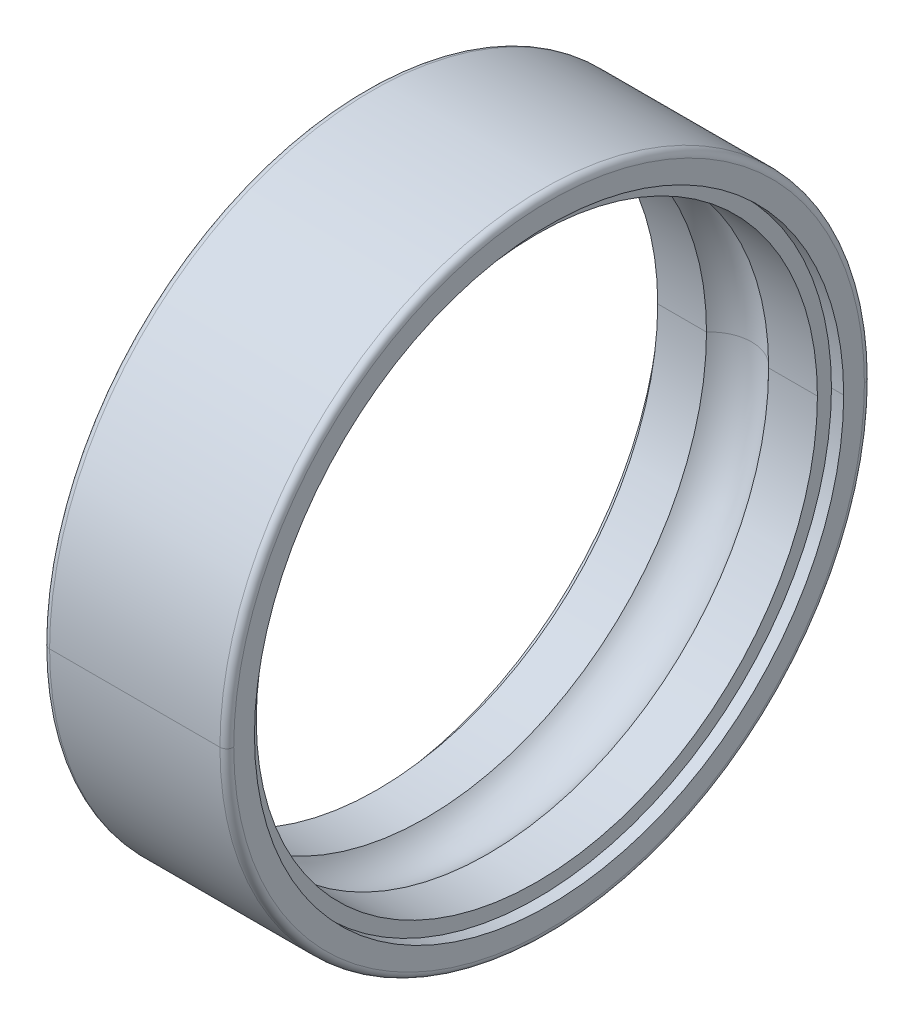
ISO-10303-21;
HEADER;
FILE_DESCRIPTION(('STEP AP214'),'2;1');
FILE_NAME('part.step','',(''),(''),'','','');
FILE_SCHEMA(('AUTOMOTIVE_DESIGN { 1 0 10303 214 1 1 1 1 }'));
ENDSEC;
DATA;
#1=APPLICATION_CONTEXT('core data for automotive mechanical design processes');
#2=APPLICATION_PROTOCOL_DEFINITION('international standard','automotive_design',2000,#1);
#3=PRODUCT_CONTEXT('',#1,'mechanical');
#4=PRODUCT('Part','Part','',(#3));
#5=PRODUCT_RELATED_PRODUCT_CATEGORY('part','',(#4));
#6=PRODUCT_DEFINITION_FORMATION('','',#4);
#7=PRODUCT_DEFINITION_CONTEXT('part definition',#1,'design');
#8=PRODUCT_DEFINITION('design','',#6,#7);
#9=PRODUCT_DEFINITION_SHAPE('','',#8);
#10=(LENGTH_UNIT() NAMED_UNIT(*) SI_UNIT(.MILLI.,.METRE.));
#11=(NAMED_UNIT(*) PLANE_ANGLE_UNIT() SI_UNIT($,.RADIAN.));
#12=(NAMED_UNIT(*) SI_UNIT($,.STERADIAN.) SOLID_ANGLE_UNIT());
#13=UNCERTAINTY_MEASURE_WITH_UNIT(LENGTH_MEASURE(1.E-05),#10,'distance_accuracy_value','');
#14=(GEOMETRIC_REPRESENTATION_CONTEXT(3) GLOBAL_UNCERTAINTY_ASSIGNED_CONTEXT((#13)) GLOBAL_UNIT_ASSIGNED_CONTEXT((#10,
#11,#12)) REPRESENTATION_CONTEXT('',''));
#15=CARTESIAN_POINT('',(0.,0.,0.));
#16=DIRECTION('',(0.,0.,1.));
#17=DIRECTION('',(1.,0.,0.));
#18=AXIS2_PLACEMENT_3D('',#15,#16,#17);
#19=CARTESIAN_POINT('',(0.,6.85,0.));
#20=DIRECTION('',(-1.,0.,0.));
#21=DIRECTION('',(0.,0.,1.));
#22=AXIS2_PLACEMENT_3D('',#19,#20,#21);
#23=PLANE('',#22);
#24=CARTESIAN_POINT('',(0.,0.,0.));
#25=DIRECTION('',(1.,0.,0.));
#26=DIRECTION('',(0.,0.,-1.));
#27=AXIS2_PLACEMENT_3D('',#24,#25,#26);
#28=CIRCLE('',#27,6.4);
#29=CARTESIAN_POINT('',(0.,0.,-6.4));
#30=VERTEX_POINT('',#29);
#31=CARTESIAN_POINT('',(0.,0.,6.4));
#32=VERTEX_POINT('',#31);
#33=EDGE_CURVE('E209',#30,#32,#28,.T.);
#34=ORIENTED_EDGE('',*,*,#33,.T.);
#35=CARTESIAN_POINT('',(0.,0.,0.));
#36=DIRECTION('',(1.,0.,0.));
#37=DIRECTION('',(0.,0.,-1.));
#38=AXIS2_PLACEMENT_3D('',#35,#36,#37);
#39=CIRCLE('',#38,6.4);
#40=EDGE_CURVE('E11',#32,#30,#39,.T.);
#41=ORIENTED_EDGE('',*,*,#40,.T.);
#42=EDGE_LOOP('',(#34,#41));
#43=FACE_BOUND('',#42,.T.);
#44=CARTESIAN_POINT('',(0.,0.,0.));
#45=DIRECTION('',(1.,0.,0.));
#46=DIRECTION('',(0.,0.,-1.));
#47=AXIS2_PLACEMENT_3D('',#44,#45,#46);
#48=CIRCLE('',#47,6.85);
#49=CARTESIAN_POINT('',(0.,0.,-6.85));
#50=VERTEX_POINT('',#49);
#51=CARTESIAN_POINT('',(0.,0.,6.85));
#52=VERTEX_POINT('',#51);
#53=EDGE_CURVE('E195',#50,#52,#48,.T.);
#54=ORIENTED_EDGE('',*,*,#53,.F.);
#55=CARTESIAN_POINT('',(0.,0.,0.));
#56=DIRECTION('',(1.,0.,0.));
#57=DIRECTION('',(0.,0.,-1.));
#58=AXIS2_PLACEMENT_3D('',#55,#56,#57);
#59=CIRCLE('',#58,6.85);
#60=EDGE_CURVE('E42',#52,#50,#59,.T.);
#61=ORIENTED_EDGE('',*,*,#60,.F.);
#62=EDGE_LOOP('',(#54,#61));
#63=FACE_BOUND('',#62,.T.);
#64=ADVANCED_FACE('F17',(#43,#63),#23,.T.);
#65=CARTESIAN_POINT('',(4.,0.,0.));
#66=DIRECTION('',(-1.,0.,0.));
#67=DIRECTION('',(0.,0.,-1.));
#68=AXIS2_PLACEMENT_3D('',#65,#66,#67);
#69=CYLINDRICAL_SURFACE('',#68,6.4);
#70=DIRECTION('',(-1.,0.,0.));
#71=VECTOR('',#70,1.);
#72=CARTESIAN_POINT('',(4.,0.,6.4));
#73=LINE('',#72,#71);
#74=CARTESIAN_POINT('',(0.2656,0.,6.4));
#75=VERTEX_POINT('',#74);
#76=EDGE_CURVE('E189',#75,#32,#73,.T.);
#77=ORIENTED_EDGE('',*,*,#76,.F.);
#78=CARTESIAN_POINT('',(0.2656,0.,0.));
#79=DIRECTION('',(1.,0.,0.));
#80=DIRECTION('',(0.,0.,-1.));
#81=AXIS2_PLACEMENT_3D('',#78,#79,#80);
#82=CIRCLE('',#81,6.4);
#83=CARTESIAN_POINT('',(0.2656,0.,-6.4));
#84=VERTEX_POINT('',#83);
#85=EDGE_CURVE('E28',#75,#84,#82,.T.);
#86=ORIENTED_EDGE('',*,*,#85,.T.);
#87=DIRECTION('',(-1.,0.,0.));
#88=VECTOR('',#87,1.);
#89=CARTESIAN_POINT('',(4.,0.,-6.4));
#90=LINE('',#89,#88);
#91=EDGE_CURVE('E213',#84,#30,#90,.T.);
#92=ORIENTED_EDGE('',*,*,#91,.T.);
#93=ORIENTED_EDGE('',*,*,#40,.F.);
#94=EDGE_LOOP('',(#77,#86,#92,#93));
#95=FACE_BOUND('',#94,.T.);
#96=ADVANCED_FACE('F288',(#95),#69,.F.);
#97=CARTESIAN_POINT('',(0.2656,6.4,0.));
#98=DIRECTION('',(-1.,0.,0.));
#99=DIRECTION('',(0.,0.,1.));
#100=AXIS2_PLACEMENT_3D('',#97,#98,#99);
#101=PLANE('',#100);
#102=CARTESIAN_POINT('',(0.2656,0.,0.));
#103=DIRECTION('',(1.,0.,0.));
#104=DIRECTION('',(0.,0.,-1.));
#105=AXIS2_PLACEMENT_3D('',#102,#103,#104);
#106=CIRCLE('',#105,6.095);
#107=CARTESIAN_POINT('',(0.2656,0.,-6.095));
#108=VERTEX_POINT('',#107);
#109=CARTESIAN_POINT('',(0.2656,0.,6.095));
#110=VERTEX_POINT('',#109);
#111=EDGE_CURVE('E230',#108,#110,#106,.T.);
#112=ORIENTED_EDGE('',*,*,#111,.T.);
#113=CARTESIAN_POINT('',(0.2656,0.,0.));
#114=DIRECTION('',(1.,0.,0.));
#115=DIRECTION('',(0.,0.,-1.));
#116=AXIS2_PLACEMENT_3D('',#113,#114,#115);
#117=CIRCLE('',#116,6.095);
#118=EDGE_CURVE('E84',#110,#108,#117,.T.);
#119=ORIENTED_EDGE('',*,*,#118,.T.);
#120=EDGE_LOOP('',(#112,#119));
#121=FACE_BOUND('',#120,.T.);
#122=CARTESIAN_POINT('',(0.2656,0.,0.));
#123=DIRECTION('',(1.,0.,0.));
#124=DIRECTION('',(0.,0.,-1.));
#125=AXIS2_PLACEMENT_3D('',#122,#123,#124);
#126=CIRCLE('',#125,6.4);
#127=EDGE_CURVE('E625',#84,#75,#126,.T.);
#128=ORIENTED_EDGE('',*,*,#127,.F.);
#129=ORIENTED_EDGE('',*,*,#85,.F.);
#130=EDGE_LOOP('',(#128,#129));
#131=FACE_BOUND('',#130,.T.);
#132=ADVANCED_FACE('F295',(#121,#131),#101,.T.);
#133=CARTESIAN_POINT('',(4.,0.,0.));
#134=DIRECTION('',(-1.,0.,0.));
#135=DIRECTION('',(0.,0.,-1.));
#136=AXIS2_PLACEMENT_3D('',#133,#134,#135);
#137=CYLINDRICAL_SURFACE('',#136,6.095);
#138=DIRECTION('',(-1.,0.,0.));
#139=VECTOR('',#138,1.);
#140=CARTESIAN_POINT('',(4.,0.,6.095));
#141=LINE('',#140,#139);
#142=CARTESIAN_POINT('',(1.32474079051078,0.,6.095));
#143=VERTEX_POINT('',#142);
#144=EDGE_CURVE('E243',#143,#110,#141,.T.);
#145=ORIENTED_EDGE('',*,*,#144,.F.);
#146=CARTESIAN_POINT('',(1.32474079051078,0.,0.));
#147=DIRECTION('',(1.,0.,0.));
#148=DIRECTION('',(0.,0.,-1.));
#149=AXIS2_PLACEMENT_3D('',#146,#147,#148);
#150=CIRCLE('',#149,6.095);
#151=CARTESIAN_POINT('',(1.32474079051078,0.,-6.095));
#152=VERTEX_POINT('',#151);
#153=EDGE_CURVE('E229',#143,#152,#150,.T.);
#154=ORIENTED_EDGE('',*,*,#153,.T.);
#155=DIRECTION('',(-1.,0.,0.));
#156=VECTOR('',#155,1.);
#157=CARTESIAN_POINT('',(4.,0.,-6.095));
#158=LINE('',#157,#156);
#159=EDGE_CURVE('E226',#152,#108,#158,.T.);
#160=ORIENTED_EDGE('',*,*,#159,.T.);
#161=ORIENTED_EDGE('',*,*,#118,.F.);
#162=EDGE_LOOP('',(#145,#154,#160,#161));
#163=FACE_BOUND('',#162,.T.);
#164=ADVANCED_FACE('F322',(#163),#137,.F.);
#165=CARTESIAN_POINT('',(2.,0.,0.));
#166=DIRECTION('',(1.,0.,0.));
#167=DIRECTION('',(0.,0.,-1.));
#168=AXIS2_PLACEMENT_3D('',#165,#166,#167);
#169=TOROIDAL_SURFACE('',#168,5.5,0.9);
#170=CARTESIAN_POINT('',(2.,0.,5.5));
#171=DIRECTION('',(0.,1.,0.));
#172=DIRECTION('',(0.,0.,1.));
#173=AXIS2_PLACEMENT_3D('',#170,#171,#172);
#174=CIRCLE('',#173,0.9);
#175=CARTESIAN_POINT('',(2.67525920948922,0.,6.095));
#176=VERTEX_POINT('',#175);
#177=EDGE_CURVE('E21',#143,#176,#174,.T.);
#178=ORIENTED_EDGE('',*,*,#177,.F.);
#179=CARTESIAN_POINT('',(1.32474079051078,0.,0.));
#180=DIRECTION('',(1.,0.,0.));
#181=DIRECTION('',(0.,0.,-1.));
#182=AXIS2_PLACEMENT_3D('',#179,#180,#181);
#183=CIRCLE('',#182,6.095);
#184=EDGE_CURVE('E223',#152,#143,#183,.T.);
#185=ORIENTED_EDGE('',*,*,#184,.F.);
#186=CARTESIAN_POINT('',(2.,0.,-5.5));
#187=DIRECTION('',(0.,-1.,0.));
#188=DIRECTION('',(0.,0.,-1.));
#189=AXIS2_PLACEMENT_3D('',#186,#187,#188);
#190=CIRCLE('',#189,0.9);
#191=CARTESIAN_POINT('',(2.67525920948922,0.,-6.095));
#192=VERTEX_POINT('',#191);
#193=EDGE_CURVE('E219',#152,#192,#190,.T.);
#194=ORIENTED_EDGE('',*,*,#193,.T.);
#195=CARTESIAN_POINT('',(2.67525920948922,0.,0.));
#196=DIRECTION('',(1.,0.,0.));
#197=DIRECTION('',(0.,0.,-1.));
#198=AXIS2_PLACEMENT_3D('',#195,#196,#197);
#199=CIRCLE('',#198,6.095);
#200=EDGE_CURVE('E70',#192,#176,#199,.T.);
#201=ORIENTED_EDGE('',*,*,#200,.T.);
#202=EDGE_LOOP('',(#178,#185,#194,#201));
#203=FACE_BOUND('',#202,.T.);
#204=ADVANCED_FACE('F304',(#203),#169,.F.);
#205=CARTESIAN_POINT('',(4.,0.,0.));
#206=DIRECTION('',(-1.,0.,0.));
#207=DIRECTION('',(0.,0.,-1.));
#208=AXIS2_PLACEMENT_3D('',#205,#206,#207);
#209=CYLINDRICAL_SURFACE('',#208,6.095);
#210=DIRECTION('',(-1.,0.,0.));
#211=VECTOR('',#210,1.);
#212=CARTESIAN_POINT('',(4.,0.,6.095));
#213=LINE('',#212,#211);
#214=CARTESIAN_POINT('',(3.7344,0.,6.095));
#215=VERTEX_POINT('',#214);
#216=EDGE_CURVE('E218',#215,#176,#213,.T.);
#217=ORIENTED_EDGE('',*,*,#216,.F.);
#218=CARTESIAN_POINT('',(3.7344,0.,0.));
#219=DIRECTION('',(1.,0.,0.));
#220=DIRECTION('',(0.,0.,-1.));
#221=AXIS2_PLACEMENT_3D('',#218,#219,#220);
#222=CIRCLE('',#221,6.095);
#223=CARTESIAN_POINT('',(3.7344,0.,-6.095));
#224=VERTEX_POINT('',#223);
#225=EDGE_CURVE('E206',#215,#224,#222,.T.);
#226=ORIENTED_EDGE('',*,*,#225,.T.);
#227=DIRECTION('',(-1.,0.,0.));
#228=VECTOR('',#227,1.);
#229=CARTESIAN_POINT('',(4.,0.,-6.095));
#230=LINE('',#229,#228);
#231=EDGE_CURVE('E252',#224,#192,#230,.T.);
#232=ORIENTED_EDGE('',*,*,#231,.T.);
#233=CARTESIAN_POINT('',(2.67525920948922,0.,0.));
#234=DIRECTION('',(1.,0.,0.));
#235=DIRECTION('',(0.,0.,-1.));
#236=AXIS2_PLACEMENT_3D('',#233,#234,#235);
#237=CIRCLE('',#236,6.095);
#238=EDGE_CURVE('E259',#176,#192,#237,.T.);
#239=ORIENTED_EDGE('',*,*,#238,.F.);
#240=EDGE_LOOP('',(#217,#226,#232,#239));
#241=FACE_BOUND('',#240,.T.);
#242=ADVANCED_FACE('F300',(#241),#209,.F.);
#243=CARTESIAN_POINT('',(3.7344,6.095,0.));
#244=DIRECTION('',(1.,0.,0.));
#245=DIRECTION('',(0.,1.,0.));
#246=AXIS2_PLACEMENT_3D('',#243,#244,#245);
#247=PLANE('',#246);
#248=CARTESIAN_POINT('',(3.7344,0.,0.));
#249=DIRECTION('',(1.,0.,0.));
#250=DIRECTION('',(0.,0.,-1.));
#251=AXIS2_PLACEMENT_3D('',#248,#249,#250);
#252=CIRCLE('',#251,6.095);
#253=EDGE_CURVE('E214',#224,#215,#252,.T.);
#254=ORIENTED_EDGE('',*,*,#253,.F.);
#255=ORIENTED_EDGE('',*,*,#225,.F.);
#256=EDGE_LOOP('',(#254,#255));
#257=FACE_BOUND('',#256,.T.);
#258=CARTESIAN_POINT('',(3.7344,0.,0.));
#259=DIRECTION('',(1.,0.,0.));
#260=DIRECTION('',(0.,0.,-1.));
#261=AXIS2_PLACEMENT_3D('',#258,#259,#260);
#262=CIRCLE('',#261,6.4);
#263=CARTESIAN_POINT('',(3.7344,0.,-6.4));
#264=VERTEX_POINT('',#263);
#265=CARTESIAN_POINT('',(3.7344,0.,6.4));
#266=VERTEX_POINT('',#265);
#267=EDGE_CURVE('E196',#264,#266,#262,.T.);
#268=ORIENTED_EDGE('',*,*,#267,.T.);
#269=CARTESIAN_POINT('',(3.7344,0.,0.));
#270=DIRECTION('',(1.,0.,0.));
#271=DIRECTION('',(0.,0.,-1.));
#272=AXIS2_PLACEMENT_3D('',#269,#270,#271);
#273=CIRCLE('',#272,6.4);
#274=EDGE_CURVE('E134',#266,#264,#273,.T.);
#275=ORIENTED_EDGE('',*,*,#274,.T.);
#276=EDGE_LOOP('',(#268,#275));
#277=FACE_BOUND('',#276,.T.);
#278=ADVANCED_FACE('F303',(#257,#277),#247,.T.);
#279=CARTESIAN_POINT('',(4.,0.,0.));
#280=DIRECTION('',(-1.,0.,0.));
#281=DIRECTION('',(0.,0.,-1.));
#282=AXIS2_PLACEMENT_3D('',#279,#280,#281);
#283=CYLINDRICAL_SURFACE('',#282,6.4);
#284=DIRECTION('',(-1.,0.,0.));
#285=VECTOR('',#284,1.);
#286=CARTESIAN_POINT('',(4.,0.,6.4));
#287=LINE('',#286,#285);
#288=CARTESIAN_POINT('',(4.,0.,6.4));
#289=VERTEX_POINT('',#288);
#290=EDGE_CURVE('E199',#289,#266,#287,.T.);
#291=ORIENTED_EDGE('',*,*,#290,.F.);
#292=CARTESIAN_POINT('',(4.,0.,0.));
#293=DIRECTION('',(1.,0.,0.));
#294=DIRECTION('',(0.,0.,-1.));
#295=AXIS2_PLACEMENT_3D('',#292,#293,#294);
#296=CIRCLE('',#295,6.4);
#297=CARTESIAN_POINT('',(4.,0.,-6.4));
#298=VERTEX_POINT('',#297);
#299=EDGE_CURVE('E145',#289,#298,#296,.T.);
#300=ORIENTED_EDGE('',*,*,#299,.T.);
#301=DIRECTION('',(-1.,0.,0.));
#302=VECTOR('',#301,1.);
#303=CARTESIAN_POINT('',(4.,0.,-6.4));
#304=LINE('',#303,#302);
#305=EDGE_CURVE('E185',#298,#264,#304,.T.);
#306=ORIENTED_EDGE('',*,*,#305,.T.);
#307=ORIENTED_EDGE('',*,*,#274,.F.);
#308=EDGE_LOOP('',(#291,#300,#306,#307));
#309=FACE_BOUND('',#308,.T.);
#310=ADVANCED_FACE('F308',(#309),#283,.F.);
#311=CARTESIAN_POINT('',(4.,6.4,0.));
#312=DIRECTION('',(1.,0.,0.));
#313=DIRECTION('',(0.,1.,0.));
#314=AXIS2_PLACEMENT_3D('',#311,#312,#313);
#315=PLANE('',#314);
#316=CARTESIAN_POINT('',(4.,0.,0.));
#317=DIRECTION('',(1.,0.,0.));
#318=DIRECTION('',(0.,0.,-1.));
#319=AXIS2_PLACEMENT_3D('',#316,#317,#318);
#320=CIRCLE('',#319,6.4);
#321=EDGE_CURVE('E255',#298,#289,#320,.T.);
#322=ORIENTED_EDGE('',*,*,#321,.F.);
#323=ORIENTED_EDGE('',*,*,#299,.F.);
#324=EDGE_LOOP('',(#322,#323));
#325=FACE_BOUND('',#324,.T.);
#326=CARTESIAN_POINT('',(4.,0.,0.));
#327=DIRECTION('',(1.,0.,0.));
#328=DIRECTION('',(0.,0.,-1.));
#329=AXIS2_PLACEMENT_3D('',#326,#327,#328);
#330=CIRCLE('',#329,6.85);
#331=CARTESIAN_POINT('',(4.,0.,-6.85));
#332=VERTEX_POINT('',#331);
#333=CARTESIAN_POINT('',(4.,0.,6.85));
#334=VERTEX_POINT('',#333);
#335=EDGE_CURVE('E170',#332,#334,#330,.T.);
#336=ORIENTED_EDGE('',*,*,#335,.T.);
#337=CARTESIAN_POINT('',(4.,0.,0.));
#338=DIRECTION('',(1.,0.,0.));
#339=DIRECTION('',(0.,0.,-1.));
#340=AXIS2_PLACEMENT_3D('',#337,#338,#339);
#341=CIRCLE('',#340,6.85);
#342=EDGE_CURVE('E157',#334,#332,#341,.T.);
#343=ORIENTED_EDGE('',*,*,#342,.T.);
#344=EDGE_LOOP('',(#336,#343));
#345=FACE_BOUND('',#344,.T.);
#346=ADVANCED_FACE('F171',(#325,#345),#315,.T.);
#347=CARTESIAN_POINT('',(3.85,0.,0.));
#348=DIRECTION('',(1.,0.,0.));
#349=DIRECTION('',(0.,0.,-1.));
#350=AXIS2_PLACEMENT_3D('',#347,#348,#349);
#351=TOROIDAL_SURFACE('',#350,6.85,0.15);
#352=CARTESIAN_POINT('',(3.85,0.,6.85));
#353=DIRECTION('',(0.,1.,0.));
#354=DIRECTION('',(0.,0.,1.));
#355=AXIS2_PLACEMENT_3D('',#352,#353,#354);
#356=CIRCLE('',#355,0.15);
#357=CARTESIAN_POINT('',(3.85,0.,7.));
#358=VERTEX_POINT('',#357);
#359=EDGE_CURVE('E162',#358,#334,#356,.T.);
#360=ORIENTED_EDGE('',*,*,#359,.F.);
#361=CARTESIAN_POINT('',(3.85,0.,0.));
#362=DIRECTION('',(1.,0.,0.));
#363=DIRECTION('',(0.,0.,-1.));
#364=AXIS2_PLACEMENT_3D('',#361,#362,#363);
#365=CIRCLE('',#364,7.);
#366=CARTESIAN_POINT('',(3.85,0.,-7.));
#367=VERTEX_POINT('',#366);
#368=EDGE_CURVE('E205',#358,#367,#365,.T.);
#369=ORIENTED_EDGE('',*,*,#368,.T.);
#370=CARTESIAN_POINT('',(3.85,0.,-6.85));
#371=DIRECTION('',(0.,-1.,0.));
#372=DIRECTION('',(0.,0.,-1.));
#373=AXIS2_PLACEMENT_3D('',#370,#371,#372);
#374=CIRCLE('',#373,0.15);
#375=EDGE_CURVE('E165',#367,#332,#374,.T.);
#376=ORIENTED_EDGE('',*,*,#375,.T.);
#377=ORIENTED_EDGE('',*,*,#342,.F.);
#378=EDGE_LOOP('',(#360,#369,#376,#377));
#379=FACE_BOUND('',#378,.T.);
#380=ADVANCED_FACE('F159',(#379),#351,.T.);
#381=CARTESIAN_POINT('',(4.,0.,0.));
#382=DIRECTION('',(-1.,0.,0.));
#383=DIRECTION('',(0.,0.,-1.));
#384=AXIS2_PLACEMENT_3D('',#381,#382,#383);
#385=CYLINDRICAL_SURFACE('',#384,7.);
#386=DIRECTION('',(-1.,0.,0.));
#387=VECTOR('',#386,1.);
#388=CARTESIAN_POINT('',(4.,0.,7.));
#389=LINE('',#388,#387);
#390=CARTESIAN_POINT('',(0.15,0.,7.));
#391=VERTEX_POINT('',#390);
#392=EDGE_CURVE('E200',#358,#391,#389,.T.);
#393=ORIENTED_EDGE('',*,*,#392,.F.);
#394=CARTESIAN_POINT('',(3.85,0.,0.));
#395=DIRECTION('',(1.,0.,0.));
#396=DIRECTION('',(0.,0.,-1.));
#397=AXIS2_PLACEMENT_3D('',#394,#395,#396);
#398=CIRCLE('',#397,7.);
#399=EDGE_CURVE('E177',#367,#358,#398,.T.);
#400=ORIENTED_EDGE('',*,*,#399,.F.);
#401=DIRECTION('',(-1.,0.,0.));
#402=VECTOR('',#401,1.);
#403=CARTESIAN_POINT('',(4.,0.,-7.));
#404=LINE('',#403,#402);
#405=CARTESIAN_POINT('',(0.15,0.,-7.));
#406=VERTEX_POINT('',#405);
#407=EDGE_CURVE('E270',#367,#406,#404,.T.);
#408=ORIENTED_EDGE('',*,*,#407,.T.);
#409=CARTESIAN_POINT('',(0.15,0.,0.));
#410=DIRECTION('',(1.,0.,0.));
#411=DIRECTION('',(0.,0.,-1.));
#412=AXIS2_PLACEMENT_3D('',#409,#410,#411);
#413=CIRCLE('',#412,7.);
#414=EDGE_CURVE('E194',#406,#391,#413,.T.);
#415=ORIENTED_EDGE('',*,*,#414,.T.);
#416=EDGE_LOOP('',(#393,#400,#408,#415));
#417=FACE_BOUND('',#416,.T.);
#418=ADVANCED_FACE('F325',(#417),#385,.T.);
#419=CARTESIAN_POINT('',(0.15,0.,0.));
#420=DIRECTION('',(1.,0.,0.));
#421=DIRECTION('',(0.,0.,-1.));
#422=AXIS2_PLACEMENT_3D('',#419,#420,#421);
#423=TOROIDAL_SURFACE('',#422,6.85,0.15);
#424=CARTESIAN_POINT('',(0.15,0.,6.85));
#425=DIRECTION('',(0.,1.,0.));
#426=DIRECTION('',(0.,0.,1.));
#427=AXIS2_PLACEMENT_3D('',#424,#425,#426);
#428=CIRCLE('',#427,0.15);
#429=EDGE_CURVE('E191',#52,#391,#428,.T.);
#430=ORIENTED_EDGE('',*,*,#429,.F.);
#431=ORIENTED_EDGE('',*,*,#60,.T.);
#432=CARTESIAN_POINT('',(0.15,0.,-6.85));
#433=DIRECTION('',(0.,-1.,0.));
#434=DIRECTION('',(0.,0.,-1.));
#435=AXIS2_PLACEMENT_3D('',#432,#433,#434);
#436=CIRCLE('',#435,0.15);
#437=EDGE_CURVE('E233',#50,#406,#436,.T.);
#438=ORIENTED_EDGE('',*,*,#437,.T.);
#439=CARTESIAN_POINT('',(0.15,0.,0.));
#440=DIRECTION('',(1.,0.,0.));
#441=DIRECTION('',(0.,0.,-1.));
#442=AXIS2_PLACEMENT_3D('',#439,#440,#441);
#443=CIRCLE('',#442,7.);
#444=EDGE_CURVE('E204',#391,#406,#443,.T.);
#445=ORIENTED_EDGE('',*,*,#444,.F.);
#446=EDGE_LOOP('',(#430,#431,#438,#445));
#447=FACE_BOUND('',#446,.T.);
#448=ADVANCED_FACE('F282',(#447),#423,.T.);
#449=CARTESIAN_POINT('',(0.15,0.,0.));
#450=DIRECTION('',(1.,0.,0.));
#451=DIRECTION('',(0.,0.,-1.));
#452=AXIS2_PLACEMENT_3D('',#449,#450,#451);
#453=TOROIDAL_SURFACE('',#452,6.85,0.15);
#454=ORIENTED_EDGE('',*,*,#53,.T.);
#455=ORIENTED_EDGE('',*,*,#429,.T.);
#456=ORIENTED_EDGE('',*,*,#414,.F.);
#457=ORIENTED_EDGE('',*,*,#437,.F.);
#458=EDGE_LOOP('',(#454,#455,#456,#457));
#459=FACE_BOUND('',#458,.T.);
#460=ADVANCED_FACE('F286',(#459),#453,.T.);
#461=CARTESIAN_POINT('',(4.,0.,0.));
#462=DIRECTION('',(-1.,0.,0.));
#463=DIRECTION('',(0.,0.,-1.));
#464=AXIS2_PLACEMENT_3D('',#461,#462,#463);
#465=CYLINDRICAL_SURFACE('',#464,7.);
#466=ORIENTED_EDGE('',*,*,#368,.F.);
#467=ORIENTED_EDGE('',*,*,#392,.T.);
#468=ORIENTED_EDGE('',*,*,#444,.T.);
#469=ORIENTED_EDGE('',*,*,#407,.F.);
#470=EDGE_LOOP('',(#466,#467,#468,#469));
#471=FACE_BOUND('',#470,.T.);
#472=ADVANCED_FACE('F329',(#471),#465,.T.);
#473=CARTESIAN_POINT('',(3.85,0.,0.));
#474=DIRECTION('',(1.,0.,0.));
#475=DIRECTION('',(0.,0.,-1.));
#476=AXIS2_PLACEMENT_3D('',#473,#474,#475);
#477=TOROIDAL_SURFACE('',#476,6.85,0.15);
#478=ORIENTED_EDGE('',*,*,#399,.T.);
#479=ORIENTED_EDGE('',*,*,#359,.T.);
#480=ORIENTED_EDGE('',*,*,#335,.F.);
#481=ORIENTED_EDGE('',*,*,#375,.F.);
#482=EDGE_LOOP('',(#478,#479,#480,#481));
#483=FACE_BOUND('',#482,.T.);
#484=ADVANCED_FACE('F175',(#483),#477,.T.);
#485=CARTESIAN_POINT('',(4.,0.,0.));
#486=DIRECTION('',(-1.,0.,0.));
#487=DIRECTION('',(0.,0.,-1.));
#488=AXIS2_PLACEMENT_3D('',#485,#486,#487);
#489=CYLINDRICAL_SURFACE('',#488,6.4);
#490=ORIENTED_EDGE('',*,*,#321,.T.);
#491=ORIENTED_EDGE('',*,*,#290,.T.);
#492=ORIENTED_EDGE('',*,*,#267,.F.);
#493=ORIENTED_EDGE('',*,*,#305,.F.);
#494=EDGE_LOOP('',(#490,#491,#492,#493));
#495=FACE_BOUND('',#494,.T.);
#496=ADVANCED_FACE('F310',(#495),#489,.F.);
#497=CARTESIAN_POINT('',(4.,0.,0.));
#498=DIRECTION('',(-1.,0.,0.));
#499=DIRECTION('',(0.,0.,-1.));
#500=AXIS2_PLACEMENT_3D('',#497,#498,#499);
#501=CYLINDRICAL_SURFACE('',#500,6.095);
#502=ORIENTED_EDGE('',*,*,#253,.T.);
#503=ORIENTED_EDGE('',*,*,#216,.T.);
#504=ORIENTED_EDGE('',*,*,#200,.F.);
#505=ORIENTED_EDGE('',*,*,#231,.F.);
#506=EDGE_LOOP('',(#502,#503,#504,#505));
#507=FACE_BOUND('',#506,.T.);
#508=ADVANCED_FACE('F313',(#507),#501,.F.);
#509=CARTESIAN_POINT('',(2.,0.,0.));
#510=DIRECTION('',(1.,0.,0.));
#511=DIRECTION('',(0.,0.,-1.));
#512=AXIS2_PLACEMENT_3D('',#509,#510,#511);
#513=TOROIDAL_SURFACE('',#512,5.5,0.9);
#514=ORIENTED_EDGE('',*,*,#153,.F.);
#515=ORIENTED_EDGE('',*,*,#177,.T.);
#516=ORIENTED_EDGE('',*,*,#238,.T.);
#517=ORIENTED_EDGE('',*,*,#193,.F.);
#518=EDGE_LOOP('',(#514,#515,#516,#517));
#519=FACE_BOUND('',#518,.T.);
#520=ADVANCED_FACE('F19',(#519),#513,.F.);
#521=CARTESIAN_POINT('',(4.,0.,0.));
#522=DIRECTION('',(-1.,0.,0.));
#523=DIRECTION('',(0.,0.,-1.));
#524=AXIS2_PLACEMENT_3D('',#521,#522,#523);
#525=CYLINDRICAL_SURFACE('',#524,6.095);
#526=ORIENTED_EDGE('',*,*,#184,.T.);
#527=ORIENTED_EDGE('',*,*,#144,.T.);
#528=ORIENTED_EDGE('',*,*,#111,.F.);
#529=ORIENTED_EDGE('',*,*,#159,.F.);
#530=EDGE_LOOP('',(#526,#527,#528,#529));
#531=FACE_BOUND('',#530,.T.);
#532=ADVANCED_FACE('F317',(#531),#525,.F.);
#533=CARTESIAN_POINT('',(4.,0.,0.));
#534=DIRECTION('',(-1.,0.,0.));
#535=DIRECTION('',(0.,0.,-1.));
#536=AXIS2_PLACEMENT_3D('',#533,#534,#535);
#537=CYLINDRICAL_SURFACE('',#536,6.4);
#538=ORIENTED_EDGE('',*,*,#127,.T.);
#539=ORIENTED_EDGE('',*,*,#76,.T.);
#540=ORIENTED_EDGE('',*,*,#33,.F.);
#541=ORIENTED_EDGE('',*,*,#91,.F.);
#542=EDGE_LOOP('',(#538,#539,#540,#541));
#543=FACE_BOUND('',#542,.T.);
#544=ADVANCED_FACE('F320',(#543),#537,.F.);
#545=CLOSED_SHELL('',(#64,#96,#132,#164,#204,#242,#278,#310,#346,#380,#418,#448,#460,#472,#484,
#496,#508,#520,#532,#544));
#546=MANIFOLD_SOLID_BREP('B1',#545);
#547=ADVANCED_BREP_SHAPE_REPRESENTATION('',(#18,#546),#14);
#548=SHAPE_DEFINITION_REPRESENTATION(#9,#547);
ENDSEC;
END-ISO-10303-21;
